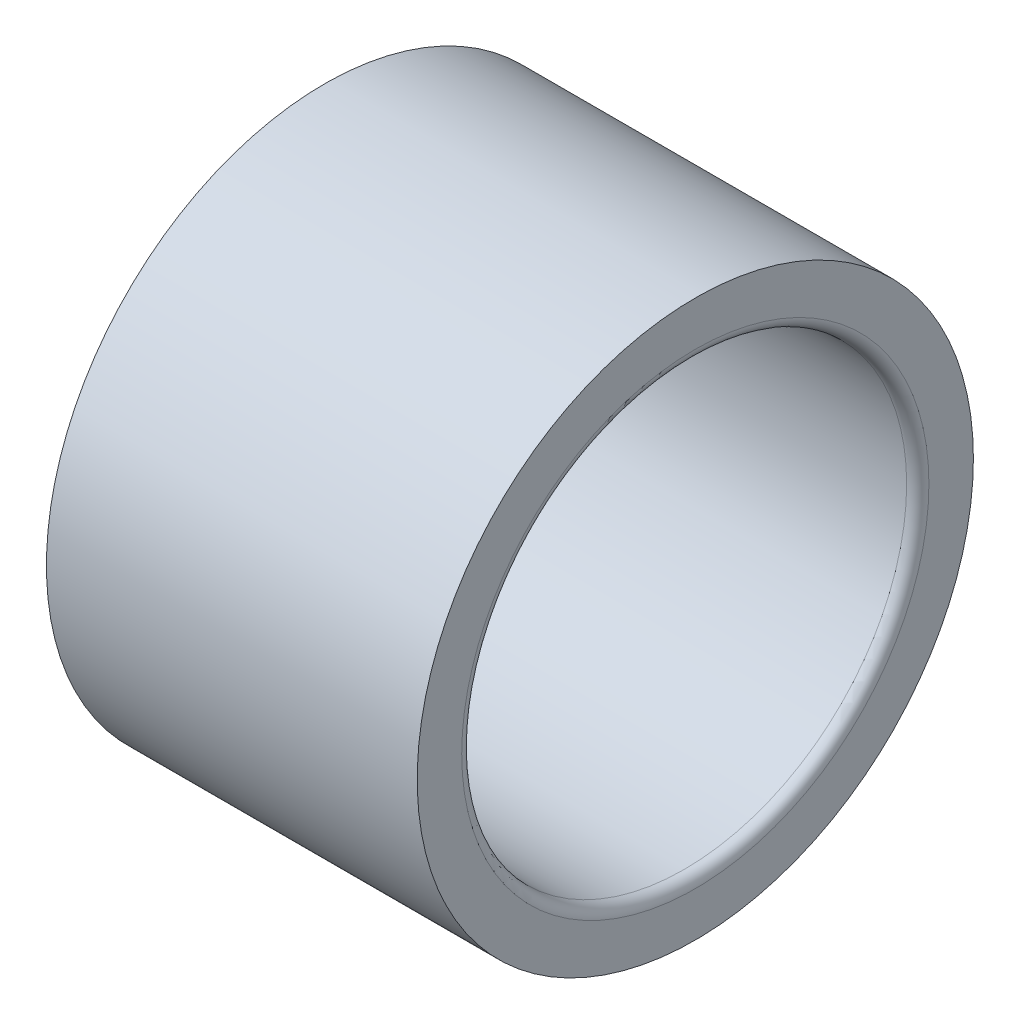
ISO-10303-21;
HEADER;
FILE_DESCRIPTION(('STEP AP214'),'2;1');
FILE_NAME('part.step','',(''),(''),'','','');
FILE_SCHEMA(('AUTOMOTIVE_DESIGN { 1 0 10303 214 1 1 1 1 }'));
ENDSEC;
DATA;
#1=APPLICATION_CONTEXT('core data for automotive mechanical design processes');
#2=APPLICATION_PROTOCOL_DEFINITION('international standard','automotive_design',2000,#1);
#3=PRODUCT_CONTEXT('',#1,'mechanical');
#4=PRODUCT('Part','Part','',(#3));
#5=PRODUCT_RELATED_PRODUCT_CATEGORY('part','',(#4));
#6=PRODUCT_DEFINITION_FORMATION('','',#4);
#7=PRODUCT_DEFINITION_CONTEXT('part definition',#1,'design');
#8=PRODUCT_DEFINITION('design','',#6,#7);
#9=PRODUCT_DEFINITION_SHAPE('','',#8);
#10=(LENGTH_UNIT() NAMED_UNIT(*) SI_UNIT(.MILLI.,.METRE.));
#11=(NAMED_UNIT(*) PLANE_ANGLE_UNIT() SI_UNIT($,.RADIAN.));
#12=(NAMED_UNIT(*) SI_UNIT($,.STERADIAN.) SOLID_ANGLE_UNIT());
#13=UNCERTAINTY_MEASURE_WITH_UNIT(LENGTH_MEASURE(1.E-05),#10,'distance_accuracy_value','');
#14=(GEOMETRIC_REPRESENTATION_CONTEXT(3) GLOBAL_UNCERTAINTY_ASSIGNED_CONTEXT((#13)) GLOBAL_UNIT_ASSIGNED_CONTEXT((#10,
#11,#12)) REPRESENTATION_CONTEXT('',''));
#15=CARTESIAN_POINT('',(0.,0.,0.));
#16=DIRECTION('',(0.,0.,1.));
#17=DIRECTION('',(1.,0.,0.));
#18=AXIS2_PLACEMENT_3D('',#15,#16,#17);
#19=CARTESIAN_POINT('',(785.,0.,0.));
#20=DIRECTION('',(1.,0.,0.));
#21=DIRECTION('',(0.,0.,-1.));
#22=AXIS2_PLACEMENT_3D('',#19,#20,#21);
#23=CYLINDRICAL_SURFACE('',#22,6.);
#24=CARTESIAN_POINT('',(780.3,0.,0.));
#25=DIRECTION('',(-1.,0.,0.));
#26=DIRECTION('',(0.,0.,1.));
#27=AXIS2_PLACEMENT_3D('',#24,#25,#26);
#28=CIRCLE('',#27,6.);
#29=CARTESIAN_POINT('',(780.3,0.,6.));
#30=VERTEX_POINT('',#29);
#31=EDGE_CURVE('E59',#30,#30,#28,.F.);
#32=ORIENTED_EDGE('',*,*,#31,.F.);
#33=EDGE_LOOP('',(#32));
#34=FACE_BOUND('',#33,.T.);
#35=CARTESIAN_POINT('',(789.7,0.,0.));
#36=DIRECTION('',(-1.,0.,0.));
#37=DIRECTION('',(0.,0.,1.));
#38=AXIS2_PLACEMENT_3D('',#35,#36,#37);
#39=CIRCLE('',#38,6.);
#40=CARTESIAN_POINT('',(789.7,0.,6.));
#41=VERTEX_POINT('',#40);
#42=EDGE_CURVE('E253',#41,#41,#39,.T.);
#43=ORIENTED_EDGE('',*,*,#42,.F.);
#44=EDGE_LOOP('',(#43));
#45=FACE_BOUND('',#44,.T.);
#46=ADVANCED_FACE('F16',(#34,#45),#23,.F.);
#47=CARTESIAN_POINT('',(789.7,0.,0.));
#48=DIRECTION('',(-1.,0.,0.));
#49=DIRECTION('',(0.,0.,1.));
#50=AXIS2_PLACEMENT_3D('',#47,#48,#49);
#51=TOROIDAL_SURFACE('',#50,6.3,0.300000000000001);
#52=ORIENTED_EDGE('',*,*,#42,.T.);
#53=EDGE_LOOP('',(#52));
#54=FACE_BOUND('',#53,.T.);
#55=CARTESIAN_POINT('',(790.,0.,0.));
#56=DIRECTION('',(1.,0.,0.));
#57=DIRECTION('',(0.,0.,-1.));
#58=AXIS2_PLACEMENT_3D('',#55,#56,#57);
#59=CIRCLE('',#58,6.3);
#60=CARTESIAN_POINT('',(790.,6.3,0.));
#61=VERTEX_POINT('',#60);
#62=CARTESIAN_POINT('',(790.,0.,-6.3));
#63=VERTEX_POINT('',#62);
#64=EDGE_CURVE('E51',#61,#63,#59,.F.);
#65=ORIENTED_EDGE('',*,*,#64,.F.);
#66=CARTESIAN_POINT('',(790.,0.,0.));
#67=DIRECTION('',(1.,0.,0.));
#68=DIRECTION('',(0.,1.,0.));
#69=AXIS2_PLACEMENT_3D('',#66,#67,#68);
#70=CIRCLE('',#69,6.3);
#71=CARTESIAN_POINT('',(790.,0.,6.3));
#72=VERTEX_POINT('',#71);
#73=EDGE_CURVE('E55',#72,#61,#70,.F.);
#74=ORIENTED_EDGE('',*,*,#73,.F.);
#75=CARTESIAN_POINT('',(790.,0.,0.));
#76=DIRECTION('',(1.,0.,0.));
#77=DIRECTION('',(0.,0.,1.));
#78=AXIS2_PLACEMENT_3D('',#75,#76,#77);
#79=CIRCLE('',#78,6.3);
#80=EDGE_CURVE('E49',#63,#72,#79,.F.);
#81=ORIENTED_EDGE('',*,*,#80,.F.);
#82=EDGE_LOOP('',(#65,#74,#81));
#83=FACE_BOUND('',#82,.T.);
#84=ADVANCED_FACE('F54',(#54,#83),#51,.T.);
#85=CARTESIAN_POINT('',(780.3,0.,0.));
#86=DIRECTION('',(-1.,0.,0.));
#87=DIRECTION('',(0.,0.,1.));
#88=AXIS2_PLACEMENT_3D('',#85,#86,#87);
#89=TOROIDAL_SURFACE('',#88,6.3,0.3);
#90=ORIENTED_EDGE('',*,*,#31,.T.);
#91=EDGE_LOOP('',(#90));
#92=FACE_BOUND('',#91,.T.);
#93=CARTESIAN_POINT('',(780.,0.,0.));
#94=DIRECTION('',(-1.,0.,0.));
#95=DIRECTION('',(0.,0.,-1.));
#96=AXIS2_PLACEMENT_3D('',#93,#94,#95);
#97=CIRCLE('',#96,6.3);
#98=CARTESIAN_POINT('',(780.,0.,6.3));
#99=VERTEX_POINT('',#98);
#100=CARTESIAN_POINT('',(780.,0.,-6.3));
#101=VERTEX_POINT('',#100);
#102=EDGE_CURVE('E35',#99,#101,#97,.F.);
#103=ORIENTED_EDGE('',*,*,#102,.F.);
#104=CARTESIAN_POINT('',(780.,0.,0.));
#105=DIRECTION('',(-1.,0.,0.));
#106=DIRECTION('',(0.,0.,1.));
#107=AXIS2_PLACEMENT_3D('',#104,#105,#106);
#108=CIRCLE('',#107,6.3);
#109=CARTESIAN_POINT('',(780.,6.3,0.));
#110=VERTEX_POINT('',#109);
#111=EDGE_CURVE('E121',#110,#99,#108,.F.);
#112=ORIENTED_EDGE('',*,*,#111,.F.);
#113=CARTESIAN_POINT('',(780.,0.,0.));
#114=DIRECTION('',(-1.,0.,0.));
#115=DIRECTION('',(0.,1.,0.));
#116=AXIS2_PLACEMENT_3D('',#113,#114,#115);
#117=CIRCLE('',#116,6.3);
#118=EDGE_CURVE('E66',#101,#110,#117,.F.);
#119=ORIENTED_EDGE('',*,*,#118,.F.);
#120=EDGE_LOOP('',(#103,#112,#119));
#121=FACE_BOUND('',#120,.T.);
#122=ADVANCED_FACE('F86',(#92,#121),#89,.T.);
#123=CARTESIAN_POINT('',(790.,6.9,0.));
#124=DIRECTION('',(1.,0.,0.));
#125=DIRECTION('',(0.,0.,-1.));
#126=AXIS2_PLACEMENT_3D('',#123,#124,#125);
#127=PLANE('',#126);
#128=ORIENTED_EDGE('',*,*,#80,.T.);
#129=ORIENTED_EDGE('',*,*,#73,.T.);
#130=ORIENTED_EDGE('',*,*,#64,.T.);
#131=EDGE_LOOP('',(#128,#129,#130));
#132=FACE_BOUND('',#131,.T.);
#133=CARTESIAN_POINT('',(790.,0.,0.));
#134=DIRECTION('',(1.,0.,0.));
#135=DIRECTION('',(0.,0.,-1.));
#136=AXIS2_PLACEMENT_3D('',#133,#134,#135);
#137=CIRCLE('',#136,7.5);
#138=CARTESIAN_POINT('',(790.,0.,-7.5));
#139=VERTEX_POINT('',#138);
#140=EDGE_CURVE('E26',#139,#139,#137,.F.);
#141=ORIENTED_EDGE('',*,*,#140,.F.);
#142=EDGE_LOOP('',(#141));
#143=FACE_BOUND('',#142,.T.);
#144=ADVANCED_FACE('F63',(#132,#143),#127,.T.);
#145=CARTESIAN_POINT('',(780.,6.9,0.));
#146=DIRECTION('',(-1.,0.,0.));
#147=DIRECTION('',(0.,0.,1.));
#148=AXIS2_PLACEMENT_3D('',#145,#146,#147);
#149=PLANE('',#148);
#150=CARTESIAN_POINT('',(780.,0.,0.));
#151=DIRECTION('',(1.,0.,0.));
#152=DIRECTION('',(0.,0.,-1.));
#153=AXIS2_PLACEMENT_3D('',#150,#151,#152);
#154=CIRCLE('',#153,7.5);
#155=CARTESIAN_POINT('',(780.,0.,-7.5));
#156=VERTEX_POINT('',#155);
#157=EDGE_CURVE('E10',#156,#156,#154,.T.);
#158=ORIENTED_EDGE('',*,*,#157,.F.);
#159=EDGE_LOOP('',(#158));
#160=FACE_BOUND('',#159,.T.);
#161=ORIENTED_EDGE('',*,*,#111,.T.);
#162=ORIENTED_EDGE('',*,*,#102,.T.);
#163=ORIENTED_EDGE('',*,*,#118,.T.);
#164=EDGE_LOOP('',(#161,#162,#163));
#165=FACE_BOUND('',#164,.T.);
#166=ADVANCED_FACE('F85',(#160,#165),#149,.T.);
#167=CARTESIAN_POINT('',(785.,0.,0.));
#168=DIRECTION('',(1.,0.,0.));
#169=DIRECTION('',(0.,0.,-1.));
#170=AXIS2_PLACEMENT_3D('',#167,#168,#169);
#171=CYLINDRICAL_SURFACE('',#170,7.5);
#172=ORIENTED_EDGE('',*,*,#140,.T.);
#173=EDGE_LOOP('',(#172));
#174=FACE_BOUND('',#173,.T.);
#175=ORIENTED_EDGE('',*,*,#157,.T.);
#176=EDGE_LOOP('',(#175));
#177=FACE_BOUND('',#176,.T.);
#178=ADVANCED_FACE('F161',(#174,#177),#171,.T.);
#179=CLOSED_SHELL('',(#46,#84,#122,#144,#166,#178));
#180=MANIFOLD_SOLID_BREP('B1',#179);
#181=ADVANCED_BREP_SHAPE_REPRESENTATION('',(#18,#180),#14);
#182=SHAPE_DEFINITION_REPRESENTATION(#9,#181);
ENDSEC;
END-ISO-10303-21;
